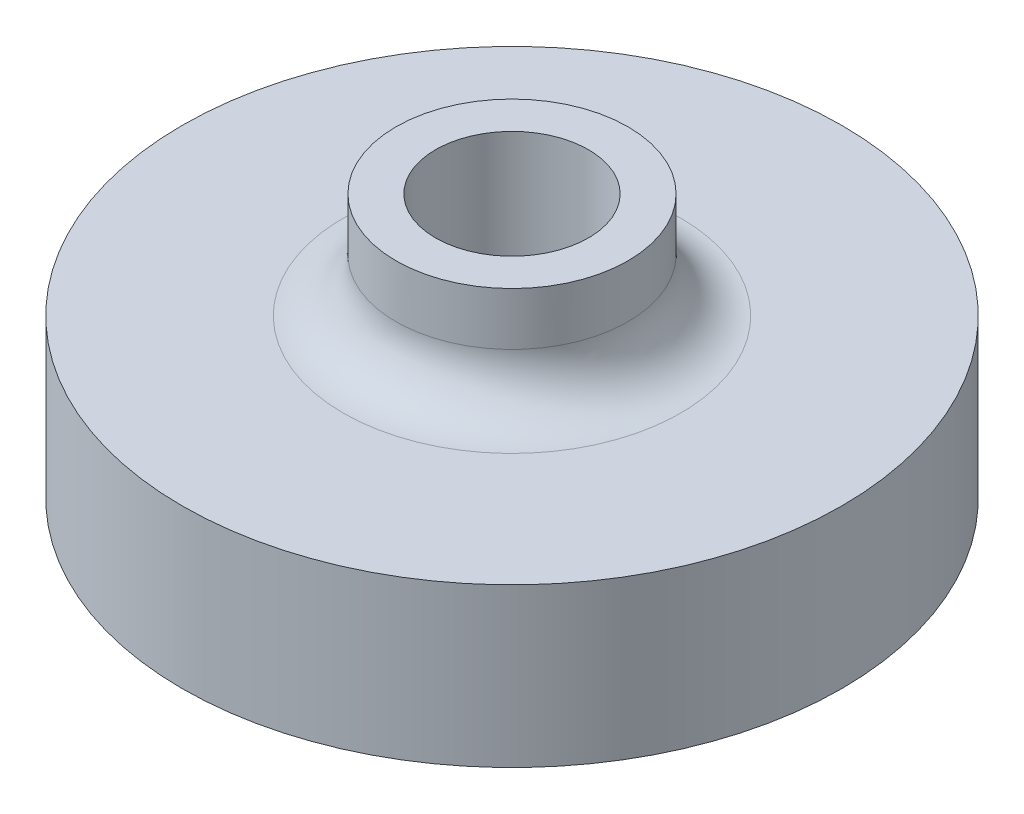
ISO-10303-21;
HEADER;
FILE_DESCRIPTION(('STEP AP214'),'2;1');
FILE_NAME('part.step','',(''),(''),'','','');
FILE_SCHEMA(('AUTOMOTIVE_DESIGN { 1 0 10303 214 1 1 1 1 }'));
ENDSEC;
DATA;
#1=APPLICATION_CONTEXT('core data for automotive mechanical design processes');
#2=APPLICATION_PROTOCOL_DEFINITION('international standard','automotive_design',2000,#1);
#3=PRODUCT_CONTEXT('',#1,'mechanical');
#4=PRODUCT('Part','Part','',(#3));
#5=PRODUCT_RELATED_PRODUCT_CATEGORY('part','',(#4));
#6=PRODUCT_DEFINITION_FORMATION('','',#4);
#7=PRODUCT_DEFINITION_CONTEXT('part definition',#1,'design');
#8=PRODUCT_DEFINITION('design','',#6,#7);
#9=PRODUCT_DEFINITION_SHAPE('','',#8);
#10=(LENGTH_UNIT() NAMED_UNIT(*) SI_UNIT(.MILLI.,.METRE.));
#11=(NAMED_UNIT(*) PLANE_ANGLE_UNIT() SI_UNIT($,.RADIAN.));
#12=(NAMED_UNIT(*) SI_UNIT($,.STERADIAN.) SOLID_ANGLE_UNIT());
#13=UNCERTAINTY_MEASURE_WITH_UNIT(LENGTH_MEASURE(1.E-05),#10,'distance_accuracy_value','');
#14=(GEOMETRIC_REPRESENTATION_CONTEXT(3) GLOBAL_UNCERTAINTY_ASSIGNED_CONTEXT((#13)) GLOBAL_UNIT_ASSIGNED_CONTEXT((#10,
#11,#12)) REPRESENTATION_CONTEXT('',''));
#15=CARTESIAN_POINT('',(0.,0.,0.));
#16=DIRECTION('',(0.,0.,1.));
#17=DIRECTION('',(1.,0.,0.));
#18=AXIS2_PLACEMENT_3D('',#15,#16,#17);
#19=CARTESIAN_POINT('',(1.5,4.5,0.));
#20=DIRECTION('',(1.,0.,0.));
#21=DIRECTION('',(0.,0.,-1.));
#22=AXIS2_PLACEMENT_3D('',#19,#20,#21);
#23=PLANE('',#22);
#24=DIRECTION('',(0.,0.,1.));
#25=VECTOR('',#24,1.);
#26=CARTESIAN_POINT('',(1.5,2.,0.));
#27=LINE('',#26,#25);
#28=CARTESIAN_POINT('',(1.5,2.,-4.99999859781734));
#29=VERTEX_POINT('',#28);
#30=CARTESIAN_POINT('',(1.5,2.,-1.15470053837924));
#31=VERTEX_POINT('',#30);
#32=EDGE_CURVE('E170',#29,#31,#27,.T.);
#33=ORIENTED_EDGE('',*,*,#32,.T.);
#34=DIRECTION('',(0.,-1.,0.));
#35=VECTOR('',#34,1.);
#36=CARTESIAN_POINT('',(1.5,4.5,-1.15470053837924));
#37=LINE('',#36,#35);
#38=CARTESIAN_POINT('',(1.5,4.5,-1.15470053837924));
#39=VERTEX_POINT('',#38);
#40=EDGE_CURVE('E169',#39,#31,#37,.T.);
#41=ORIENTED_EDGE('',*,*,#40,.F.);
#42=DIRECTION('',(0.,0.,1.));
#43=VECTOR('',#42,1.);
#44=CARTESIAN_POINT('',(1.5,4.5,0.));
#45=LINE('',#44,#43);
#46=CARTESIAN_POINT('',(1.5,4.5,-4.99999859781734));
#47=VERTEX_POINT('',#46);
#48=EDGE_CURVE('E185',#47,#39,#45,.T.);
#49=ORIENTED_EDGE('',*,*,#48,.F.);
#50=DIRECTION('',(0.,-1.,0.));
#51=VECTOR('',#50,1.);
#52=CARTESIAN_POINT('',(1.5,4.5,-4.99999859781734));
#53=LINE('',#52,#51);
#54=EDGE_CURVE('E56',#47,#29,#53,.T.);
#55=ORIENTED_EDGE('',*,*,#54,.T.);
#56=EDGE_LOOP('',(#33,#41,#49,#55));
#57=FACE_BOUND('',#56,.T.);
#58=ADVANCED_FACE('F46',(#57),#23,.F.);
#59=CARTESIAN_POINT('',(0.,4.5,-4.99999859781734));
#60=DIRECTION('',(0.,-1.,0.));
#61=DIRECTION('',(0.,0.,-1.));
#62=AXIS2_PLACEMENT_3D('',#59,#60,#61);
#63=CYLINDRICAL_SURFACE('',#62,1.5);
#64=DIRECTION('',(0.,-1.,0.));
#65=VECTOR('',#64,1.);
#66=CARTESIAN_POINT('',(-1.5,4.5,-4.99999859781734));
#67=LINE('',#66,#65);
#68=CARTESIAN_POINT('',(-1.5,4.5,-4.99999859781734));
#69=VERTEX_POINT('',#68);
#70=CARTESIAN_POINT('',(-1.50000028335584,2.,-4.99999859781734));
#71=VERTEX_POINT('',#70);
#72=EDGE_CURVE('E142',#69,#71,#67,.T.);
#73=ORIENTED_EDGE('',*,*,#72,.T.);
#74=CARTESIAN_POINT('',(0.,2.,-4.99999859781734));
#75=DIRECTION('',(0.,-1.,0.));
#76=DIRECTION('',(0.,0.,-1.));
#77=AXIS2_PLACEMENT_3D('',#74,#75,#76);
#78=CIRCLE('',#77,1.50000028335584);
#79=EDGE_CURVE('E113',#29,#71,#78,.T.);
#80=ORIENTED_EDGE('',*,*,#79,.F.);
#81=ORIENTED_EDGE('',*,*,#54,.F.);
#82=CARTESIAN_POINT('',(0.,4.5,-4.99999859781734));
#83=DIRECTION('',(0.,-1.,0.));
#84=DIRECTION('',(0.,0.,-1.));
#85=AXIS2_PLACEMENT_3D('',#82,#83,#84);
#86=CIRCLE('',#85,1.5);
#87=EDGE_CURVE('E146',#69,#47,#86,.T.);
#88=ORIENTED_EDGE('',*,*,#87,.F.);
#89=EDGE_LOOP('',(#73,#80,#81,#88));
#90=FACE_BOUND('',#89,.T.);
#91=CARTESIAN_POINT('',(0.,0.,-4.99999859781734));
#92=DIRECTION('',(0.,-1.,0.));
#93=DIRECTION('',(0.,0.,-1.));
#94=AXIS2_PLACEMENT_3D('',#91,#92,#93);
#95=CIRCLE('',#94,1.50000028335584);
#96=CARTESIAN_POINT('',(0.,0.,-6.49999888117318));
#97=VERTEX_POINT('',#96);
#98=EDGE_CURVE('E213',#97,#97,#95,.T.);
#99=ORIENTED_EDGE('',*,*,#98,.T.);
#100=EDGE_LOOP('',(#99));
#101=FACE_BOUND('',#100,.T.);
#102=ADVANCED_FACE('F317',(#90,#101),#63,.F.);
#103=CARTESIAN_POINT('',(-1.5,4.5,0.));
#104=DIRECTION('',(1.,0.,0.));
#105=DIRECTION('',(0.,0.,-1.));
#106=AXIS2_PLACEMENT_3D('',#103,#104,#105);
#107=PLANE('',#106);
#108=DIRECTION('',(0.,0.,1.));
#109=VECTOR('',#108,1.);
#110=CARTESIAN_POINT('',(-1.5,2.,0.));
#111=LINE('',#110,#109);
#112=CARTESIAN_POINT('',(-1.5,2.,0.));
#113=VERTEX_POINT('',#112);
#114=EDGE_CURVE('E183',#71,#113,#111,.T.);
#115=ORIENTED_EDGE('',*,*,#114,.F.);
#116=ORIENTED_EDGE('',*,*,#72,.F.);
#117=DIRECTION('',(0.,0.,1.));
#118=VECTOR('',#117,1.);
#119=CARTESIAN_POINT('',(-1.5,4.5,0.));
#120=LINE('',#119,#118);
#121=CARTESIAN_POINT('',(-1.5,4.5,0.));
#122=VERTEX_POINT('',#121);
#123=EDGE_CURVE('E137',#69,#122,#120,.T.);
#124=ORIENTED_EDGE('',*,*,#123,.T.);
#125=DIRECTION('',(0.,-1.,0.));
#126=VECTOR('',#125,1.);
#127=CARTESIAN_POINT('',(-1.5,4.5,0.));
#128=LINE('',#127,#126);
#129=EDGE_CURVE('E141',#122,#113,#128,.T.);
#130=ORIENTED_EDGE('',*,*,#129,.T.);
#131=EDGE_LOOP('',(#115,#116,#124,#130));
#132=FACE_BOUND('',#131,.T.);
#133=ADVANCED_FACE('F140',(#132),#107,.T.);
#134=CARTESIAN_POINT('',(0.,4.5,0.));
#135=DIRECTION('',(0.,-1.,0.));
#136=DIRECTION('',(0.,0.,-1.));
#137=AXIS2_PLACEMENT_3D('',#134,#135,#136);
#138=CYLINDRICAL_SURFACE('',#137,1.5);
#139=DIRECTION('',(0.,-1.,0.));
#140=VECTOR('',#139,1.);
#141=CARTESIAN_POINT('',(-0.749999999999991,4.5,1.29903810567666));
#142=LINE('',#141,#140);
#143=CARTESIAN_POINT('',(-0.749999999999991,4.5,1.29903810567666));
#144=VERTEX_POINT('',#143);
#145=CARTESIAN_POINT('',(-0.749999999999991,2.,1.29903810567666));
#146=VERTEX_POINT('',#145);
#147=EDGE_CURVE('E156',#144,#146,#142,.T.);
#148=ORIENTED_EDGE('',*,*,#147,.T.);
#149=CARTESIAN_POINT('',(0.,2.,0.));
#150=DIRECTION('',(0.,-1.,0.));
#151=DIRECTION('',(0.,0.,-1.));
#152=AXIS2_PLACEMENT_3D('',#149,#150,#151);
#153=CIRCLE('',#152,1.5);
#154=EDGE_CURVE('E155',#113,#146,#153,.T.);
#155=ORIENTED_EDGE('',*,*,#154,.F.);
#156=ORIENTED_EDGE('',*,*,#129,.F.);
#157=CARTESIAN_POINT('',(0.,4.5,0.));
#158=DIRECTION('',(0.,-1.,0.));
#159=DIRECTION('',(0.,0.,-1.));
#160=AXIS2_PLACEMENT_3D('',#157,#158,#159);
#161=CIRCLE('',#160,1.5);
#162=EDGE_CURVE('E147',#144,#122,#161,.T.);
#163=ORIENTED_EDGE('',*,*,#162,.F.);
#164=EDGE_LOOP('',(#148,#155,#156,#163));
#165=FACE_BOUND('',#164,.T.);
#166=CARTESIAN_POINT('',(0.,0.,0.));
#167=DIRECTION('',(0.,-1.,0.));
#168=DIRECTION('',(0.,0.,-1.));
#169=AXIS2_PLACEMENT_3D('',#166,#167,#168);
#170=CIRCLE('',#169,1.5);
#171=CARTESIAN_POINT('',(0.,0.,-1.5));
#172=VERTEX_POINT('',#171);
#173=EDGE_CURVE('E254',#172,#172,#170,.T.);
#174=ORIENTED_EDGE('',*,*,#173,.T.);
#175=EDGE_LOOP('',(#174));
#176=FACE_BOUND('',#175,.T.);
#177=ADVANCED_FACE('F153',(#165,#176),#138,.F.);
#178=CARTESIAN_POINT('',(-0.749999999999997,4.5,1.29903810567666));
#179=DIRECTION('',(0.499999999999998,0.,-0.86602540378444));
#180=DIRECTION('',(-0.86602540378444,0.,-0.499999999999998));
#181=AXIS2_PLACEMENT_3D('',#178,#179,#180);
#182=PLANE('',#181);
#183=DIRECTION('',(0.86602540378444,0.,0.499999999999998));
#184=VECTOR('',#183,1.);
#185=CARTESIAN_POINT('',(-0.749999999999997,2.,1.29903810567666));
#186=LINE('',#185,#184);
#187=CARTESIAN_POINT('',(3.58012739648833,2.,3.79903832366455));
#188=VERTEX_POINT('',#187);
#189=EDGE_CURVE('E180',#146,#188,#186,.T.);
#190=ORIENTED_EDGE('',*,*,#189,.F.);
#191=ORIENTED_EDGE('',*,*,#147,.F.);
#192=DIRECTION('',(0.86602540378444,0.,0.499999999999998));
#193=VECTOR('',#192,1.);
#194=CARTESIAN_POINT('',(-0.749999999999997,4.5,1.29903810567666));
#195=LINE('',#194,#193);
#196=CARTESIAN_POINT('',(3.58012739648833,4.5,3.79903832366455));
#197=VERTEX_POINT('',#196);
#198=EDGE_CURVE('E162',#144,#197,#195,.T.);
#199=ORIENTED_EDGE('',*,*,#198,.T.);
#200=DIRECTION('',(0.,-1.,0.));
#201=VECTOR('',#200,1.);
#202=CARTESIAN_POINT('',(3.58012739648833,4.5,3.79903832366455));
#203=LINE('',#202,#201);
#204=EDGE_CURVE('E189',#197,#188,#203,.T.);
#205=ORIENTED_EDGE('',*,*,#204,.T.);
#206=EDGE_LOOP('',(#190,#191,#199,#205));
#207=FACE_BOUND('',#206,.T.);
#208=ADVANCED_FACE('F280',(#207),#182,.T.);
#209=CARTESIAN_POINT('',(4.33012739648833,4.5,2.5000002179879));
#210=DIRECTION('',(0.,-1.,0.));
#211=DIRECTION('',(0.,0.,-1.));
#212=AXIS2_PLACEMENT_3D('',#209,#210,#211);
#213=CYLINDRICAL_SURFACE('',#212,1.5);
#214=DIRECTION('',(0.,-1.,0.));
#215=VECTOR('',#214,1.);
#216=CARTESIAN_POINT('',(5.08012701892206,4.5,1.20096189432333));
#217=LINE('',#216,#215);
#218=CARTESIAN_POINT('',(5.08012701892206,4.5,1.20096189432333));
#219=VERTEX_POINT('',#218);
#220=CARTESIAN_POINT('',(5.08012701892206,2.,1.20096189432333));
#221=VERTEX_POINT('',#220);
#222=EDGE_CURVE('E192',#219,#221,#217,.T.);
#223=ORIENTED_EDGE('',*,*,#222,.T.);
#224=CARTESIAN_POINT('',(4.33012739648833,2.,2.5000002179879));
#225=DIRECTION('',(0.,-1.,0.));
#226=DIRECTION('',(0.,0.,-1.));
#227=AXIS2_PLACEMENT_3D('',#224,#225,#226);
#228=CIRCLE('',#227,1.5);
#229=EDGE_CURVE('E248',#188,#221,#228,.T.);
#230=ORIENTED_EDGE('',*,*,#229,.F.);
#231=ORIENTED_EDGE('',*,*,#204,.F.);
#232=CARTESIAN_POINT('',(4.33012739648833,4.5,2.5000002179879));
#233=DIRECTION('',(0.,-1.,0.));
#234=DIRECTION('',(0.,0.,-1.));
#235=AXIS2_PLACEMENT_3D('',#232,#233,#234);
#236=CIRCLE('',#235,1.5);
#237=EDGE_CURVE('E164',#219,#197,#236,.T.);
#238=ORIENTED_EDGE('',*,*,#237,.F.);
#239=EDGE_LOOP('',(#223,#230,#231,#238));
#240=FACE_BOUND('',#239,.T.);
#241=CARTESIAN_POINT('',(4.33012739648833,0.,2.5000002179879));
#242=DIRECTION('',(0.,-1.,0.));
#243=DIRECTION('',(0.,0.,-1.));
#244=AXIS2_PLACEMENT_3D('',#241,#242,#243);
#245=CIRCLE('',#244,1.5);
#246=CARTESIAN_POINT('',(4.33012739648833,0.,1.0000002179879));
#247=VERTEX_POINT('',#246);
#248=EDGE_CURVE('E250',#247,#247,#245,.T.);
#249=ORIENTED_EDGE('',*,*,#248,.T.);
#250=EDGE_LOOP('',(#249));
#251=FACE_BOUND('',#250,.T.);
#252=ADVANCED_FACE('F275',(#240,#251),#213,.F.);
#253=CARTESIAN_POINT('',(0.750000000000017,4.5,-1.29903810567665));
#254=DIRECTION('',(-0.50000000000001,0.,0.866025403784433));
#255=DIRECTION('',(0.866025403784433,0.,0.50000000000001));
#256=AXIS2_PLACEMENT_3D('',#253,#254,#255);
#257=PLANE('',#256);
#258=DIRECTION('',(-0.866025403784433,0.,-0.50000000000001));
#259=VECTOR('',#258,1.);
#260=CARTESIAN_POINT('',(0.750000000000017,2.,-1.29903810567665));
#261=LINE('',#260,#259);
#262=CARTESIAN_POINT('',(1.75,2.,-0.721687836487021));
#263=VERTEX_POINT('',#262);
#264=EDGE_CURVE('E177',#221,#263,#261,.T.);
#265=ORIENTED_EDGE('',*,*,#264,.F.);
#266=ORIENTED_EDGE('',*,*,#222,.F.);
#267=DIRECTION('',(-0.866025403784433,0.,-0.50000000000001));
#268=VECTOR('',#267,1.);
#269=CARTESIAN_POINT('',(0.750000000000017,4.5,-1.29903810567665));
#270=LINE('',#269,#268);
#271=CARTESIAN_POINT('',(1.75,4.5,-0.721687836487021));
#272=VERTEX_POINT('',#271);
#273=EDGE_CURVE('E270',#219,#272,#270,.T.);
#274=ORIENTED_EDGE('',*,*,#273,.T.);
#275=DIRECTION('',(0.,-1.,0.));
#276=VECTOR('',#275,1.);
#277=CARTESIAN_POINT('',(1.75,4.5,-0.721687836487021));
#278=LINE('',#277,#276);
#279=EDGE_CURVE('E195',#272,#263,#278,.T.);
#280=ORIENTED_EDGE('',*,*,#279,.T.);
#281=EDGE_LOOP('',(#265,#266,#274,#280));
#282=FACE_BOUND('',#281,.T.);
#283=ADVANCED_FACE('F327',(#282),#257,.T.);
#284=CARTESIAN_POINT('',(2.,4.5,-1.15470053837924));
#285=DIRECTION('',(0.,-1.,0.));
#286=DIRECTION('',(0.,0.,-1.));
#287=AXIS2_PLACEMENT_3D('',#284,#285,#286);
#288=CYLINDRICAL_SURFACE('',#287,0.499999999999999);
#289=CARTESIAN_POINT('',(2.,2.,-1.15470053837924));
#290=DIRECTION('',(0.,-1.,0.));
#291=DIRECTION('',(0.,0.,-1.));
#292=AXIS2_PLACEMENT_3D('',#289,#290,#291);
#293=CIRCLE('',#292,0.499999999999999);
#294=EDGE_CURVE('E173',#31,#263,#293,.F.);
#295=ORIENTED_EDGE('',*,*,#294,.T.);
#296=ORIENTED_EDGE('',*,*,#279,.F.);
#297=CARTESIAN_POINT('',(2.,4.5,-1.15470053837924));
#298=DIRECTION('',(0.,-1.,0.));
#299=DIRECTION('',(0.,0.,-1.));
#300=AXIS2_PLACEMENT_3D('',#297,#298,#299);
#301=CIRCLE('',#300,0.499999999999999);
#302=EDGE_CURVE('E267',#39,#272,#301,.F.);
#303=ORIENTED_EDGE('',*,*,#302,.F.);
#304=ORIENTED_EDGE('',*,*,#40,.T.);
#305=EDGE_LOOP('',(#295,#296,#303,#304));
#306=FACE_BOUND('',#305,.T.);
#307=ADVANCED_FACE('F324',(#306),#288,.T.);
#308=CARTESIAN_POINT('',(0.,4.5,0.));
#309=DIRECTION('',(0.,-1.,0.));
#310=DIRECTION('',(0.,0.,-1.));
#311=AXIS2_PLACEMENT_3D('',#308,#309,#310);
#312=PLANE('',#311);
#313=ORIENTED_EDGE('',*,*,#48,.T.);
#314=ORIENTED_EDGE('',*,*,#302,.T.);
#315=ORIENTED_EDGE('',*,*,#273,.F.);
#316=ORIENTED_EDGE('',*,*,#237,.T.);
#317=ORIENTED_EDGE('',*,*,#198,.F.);
#318=ORIENTED_EDGE('',*,*,#162,.T.);
#319=ORIENTED_EDGE('',*,*,#123,.F.);
#320=ORIENTED_EDGE('',*,*,#87,.T.);
#321=EDGE_LOOP('',(#313,#314,#315,#316,#317,#318,#319,#320));
#322=FACE_BOUND('',#321,.T.);
#323=ADVANCED_FACE('F160',(#322),#312,.T.);
#324=CARTESIAN_POINT('',(0.,2.,0.));
#325=DIRECTION('',(0.,-1.,0.));
#326=DIRECTION('',(0.,0.,-1.));
#327=AXIS2_PLACEMENT_3D('',#324,#325,#326);
#328=PLANE('',#327);
#329=ORIENTED_EDGE('',*,*,#32,.F.);
#330=ORIENTED_EDGE('',*,*,#79,.T.);
#331=ORIENTED_EDGE('',*,*,#114,.T.);
#332=ORIENTED_EDGE('',*,*,#154,.T.);
#333=ORIENTED_EDGE('',*,*,#189,.T.);
#334=ORIENTED_EDGE('',*,*,#229,.T.);
#335=ORIENTED_EDGE('',*,*,#264,.T.);
#336=ORIENTED_EDGE('',*,*,#294,.F.);
#337=EDGE_LOOP('',(#329,#330,#331,#332,#333,#334,#335,#336));
#338=FACE_BOUND('',#337,.T.);
#339=ADVANCED_FACE('F281',(#338),#328,.F.);
#340=CARTESIAN_POINT('',(0.,10.,0.));
#341=DIRECTION('',(0.,-1.,0.));
#342=DIRECTION('',(0.,0.,-1.));
#343=AXIS2_PLACEMENT_3D('',#340,#341,#342);
#344=CYLINDRICAL_SURFACE('',#343,12.4999999999993);
#345=CARTESIAN_POINT('',(0.,6.,0.));
#346=DIRECTION('',(0.,-1.,0.));
#347=DIRECTION('',(0.,0.,-1.));
#348=AXIS2_PLACEMENT_3D('',#345,#346,#347);
#349=CIRCLE('',#348,12.4999999999993);
#350=CARTESIAN_POINT('',(0.,6.,-12.4999999999993));
#351=VERTEX_POINT('',#350);
#352=EDGE_CURVE('E50',#351,#351,#349,.T.);
#353=ORIENTED_EDGE('',*,*,#352,.T.);
#354=EDGE_LOOP('',(#353));
#355=FACE_BOUND('',#354,.T.);
#356=CARTESIAN_POINT('',(0.,0.,0.));
#357=DIRECTION('',(0.,1.,0.));
#358=DIRECTION('',(0.,0.,1.));
#359=AXIS2_PLACEMENT_3D('',#356,#357,#358);
#360=CIRCLE('',#359,12.4999999999993);
#361=CARTESIAN_POINT('',(0.,0.,12.4999999999993));
#362=VERTEX_POINT('',#361);
#363=EDGE_CURVE('E11',#362,#362,#360,.T.);
#364=ORIENTED_EDGE('',*,*,#363,.T.);
#365=EDGE_LOOP('',(#364));
#366=FACE_BOUND('',#365,.T.);
#367=ADVANCED_FACE('F48',(#355,#366),#344,.T.);
#368=CARTESIAN_POINT('',(0.,0.,0.));
#369=DIRECTION('',(0.,1.,0.));
#370=DIRECTION('',(0.,0.,1.));
#371=AXIS2_PLACEMENT_3D('',#368,#369,#370);
#372=PLANE('',#371);
#373=ORIENTED_EDGE('',*,*,#98,.F.);
#374=EDGE_LOOP('',(#373));
#375=FACE_BOUND('',#374,.T.);
#376=ORIENTED_EDGE('',*,*,#248,.F.);
#377=EDGE_LOOP('',(#376));
#378=FACE_BOUND('',#377,.T.);
#379=ORIENTED_EDGE('',*,*,#173,.F.);
#380=EDGE_LOOP('',(#379));
#381=FACE_BOUND('',#380,.T.);
#382=CARTESIAN_POINT('',(-8.6602540378444,0.,4.99999999999998));
#383=DIRECTION('',(0.,-1.,0.));
#384=DIRECTION('',(0.,0.,-1.));
#385=AXIS2_PLACEMENT_3D('',#382,#383,#384);
#386=CIRCLE('',#385,1.5);
#387=CARTESIAN_POINT('',(-8.6602540378444,0.,3.49999999999998));
#388=VERTEX_POINT('',#387);
#389=EDGE_CURVE('E258',#388,#388,#386,.T.);
#390=ORIENTED_EDGE('',*,*,#389,.F.);
#391=EDGE_LOOP('',(#390));
#392=FACE_BOUND('',#391,.T.);
#393=CARTESIAN_POINT('',(-4.3301270189222,0.,2.49999999999999));
#394=DIRECTION('',(0.,-1.,0.));
#395=DIRECTION('',(0.,0.,-1.));
#396=AXIS2_PLACEMENT_3D('',#393,#394,#395);
#397=CIRCLE('',#396,1.5);
#398=CARTESIAN_POINT('',(-4.3301270189222,0.,0.999999999999988));
#399=VERTEX_POINT('',#398);
#400=EDGE_CURVE('E242',#399,#399,#397,.T.);
#401=ORIENTED_EDGE('',*,*,#400,.F.);
#402=EDGE_LOOP('',(#401));
#403=FACE_BOUND('',#402,.T.);
#404=ORIENTED_EDGE('',*,*,#363,.F.);
#405=EDGE_LOOP('',(#404));
#406=FACE_BOUND('',#405,.T.);
#407=ADVANCED_FACE('F396',(#375,#378,#381,#392,#403,#406),#372,.F.);
#408=CARTESIAN_POINT('',(0.749999999999996,4.5,1.29903810567666));
#409=DIRECTION('',(-0.499999999999998,0.,-0.86602540378444));
#410=DIRECTION('',(-0.86602540378444,0.,0.499999999999998));
#411=AXIS2_PLACEMENT_3D('',#408,#409,#410);
#412=PLANE('',#411);
#413=DIRECTION('',(0.86602540378444,0.,-0.499999999999998));
#414=VECTOR('',#413,1.);
#415=CARTESIAN_POINT('',(0.749999999999996,2.,1.29903810567666));
#416=LINE('',#415,#414);
#417=CARTESIAN_POINT('',(-7.9102540378444,2.,6.29903810567664));
#418=VERTEX_POINT('',#417);
#419=CARTESIAN_POINT('',(-3.5801270189222,2.,3.79903810567665));
#420=VERTEX_POINT('',#419);
#421=EDGE_CURVE('E211',#418,#420,#416,.T.);
#422=ORIENTED_EDGE('',*,*,#421,.F.);
#423=DIRECTION('',(0.,-1.,0.));
#424=VECTOR('',#423,1.);
#425=CARTESIAN_POINT('',(-7.9102540378444,4.5,6.29903810567664));
#426=LINE('',#425,#424);
#427=CARTESIAN_POINT('',(-7.9102540378444,4.5,6.29903810567664));
#428=VERTEX_POINT('',#427);
#429=EDGE_CURVE('E210',#428,#418,#426,.T.);
#430=ORIENTED_EDGE('',*,*,#429,.F.);
#431=DIRECTION('',(0.86602540378444,0.,-0.499999999999998));
#432=VECTOR('',#431,1.);
#433=CARTESIAN_POINT('',(0.749999999999996,4.5,1.29903810567666));
#434=LINE('',#433,#432);
#435=CARTESIAN_POINT('',(-3.5801270189222,4.5,3.79903810567665));
#436=VERTEX_POINT('',#435);
#437=EDGE_CURVE('E198',#428,#436,#434,.T.);
#438=ORIENTED_EDGE('',*,*,#437,.T.);
#439=DIRECTION('',(0.,-1.,0.));
#440=VECTOR('',#439,1.);
#441=CARTESIAN_POINT('',(-3.5801270189222,4.5,3.79903810567665));
#442=LINE('',#441,#440);
#443=EDGE_CURVE('E174',#436,#420,#442,.T.);
#444=ORIENTED_EDGE('',*,*,#443,.T.);
#445=EDGE_LOOP('',(#422,#430,#438,#444));
#446=FACE_BOUND('',#445,.T.);
#447=ADVANCED_FACE('F302',(#446),#412,.T.);
#448=CARTESIAN_POINT('',(-4.3301270189222,4.5,2.49999999999999));
#449=DIRECTION('',(0.,-1.,0.));
#450=DIRECTION('',(0.,0.,-1.));
#451=AXIS2_PLACEMENT_3D('',#448,#449,#450);
#452=CYLINDRICAL_SURFACE('',#451,1.5);
#453=DIRECTION('',(0.,-1.,0.));
#454=VECTOR('',#453,1.);
#455=CARTESIAN_POINT('',(-5.0801270189222,4.5,1.20096189432333));
#456=LINE('',#455,#454);
#457=CARTESIAN_POINT('',(-5.0801270189222,4.5,1.20096189432333));
#458=VERTEX_POINT('',#457);
#459=CARTESIAN_POINT('',(-5.0801270189222,2.,1.20096189432333));
#460=VERTEX_POINT('',#459);
#461=EDGE_CURVE('E218',#458,#460,#456,.T.);
#462=ORIENTED_EDGE('',*,*,#461,.T.);
#463=CARTESIAN_POINT('',(-4.3301270189222,2.,2.49999999999999));
#464=DIRECTION('',(0.,-1.,0.));
#465=DIRECTION('',(0.,0.,-1.));
#466=AXIS2_PLACEMENT_3D('',#463,#464,#465);
#467=CIRCLE('',#466,1.5);
#468=EDGE_CURVE('E261',#420,#460,#467,.T.);
#469=ORIENTED_EDGE('',*,*,#468,.F.);
#470=ORIENTED_EDGE('',*,*,#443,.F.);
#471=CARTESIAN_POINT('',(-4.3301270189222,4.5,2.49999999999999));
#472=DIRECTION('',(0.,-1.,0.));
#473=DIRECTION('',(0.,0.,-1.));
#474=AXIS2_PLACEMENT_3D('',#471,#472,#473);
#475=CIRCLE('',#474,1.5);
#476=EDGE_CURVE('E207',#458,#436,#475,.T.);
#477=ORIENTED_EDGE('',*,*,#476,.F.);
#478=EDGE_LOOP('',(#462,#469,#470,#477));
#479=FACE_BOUND('',#478,.T.);
#480=ORIENTED_EDGE('',*,*,#400,.T.);
#481=EDGE_LOOP('',(#480));
#482=FACE_BOUND('',#481,.T.);
#483=ADVANCED_FACE('F291',(#479,#482),#452,.F.);
#484=CARTESIAN_POINT('',(-0.749999999999997,4.5,-1.29903810567666));
#485=DIRECTION('',(-0.499999999999998,0.,-0.86602540378444));
#486=DIRECTION('',(-0.86602540378444,0.,0.499999999999998));
#487=AXIS2_PLACEMENT_3D('',#484,#485,#486);
#488=PLANE('',#487);
#489=DIRECTION('',(0.86602540378444,0.,-0.499999999999998));
#490=VECTOR('',#489,1.);
#491=CARTESIAN_POINT('',(-0.749999999999997,2.,-1.29903810567666));
#492=LINE('',#491,#490);
#493=CARTESIAN_POINT('',(-9.4102540378444,2.,3.70096189432332));
#494=VERTEX_POINT('',#493);
#495=EDGE_CURVE('E201',#494,#460,#492,.T.);
#496=ORIENTED_EDGE('',*,*,#495,.T.);
#497=ORIENTED_EDGE('',*,*,#461,.F.);
#498=DIRECTION('',(0.86602540378444,0.,-0.499999999999998));
#499=VECTOR('',#498,1.);
#500=CARTESIAN_POINT('',(-0.749999999999997,4.5,-1.29903810567666));
#501=LINE('',#500,#499);
#502=CARTESIAN_POINT('',(-9.41025403784439,4.5,3.70096189432331));
#503=VERTEX_POINT('',#502);
#504=EDGE_CURVE('E204',#503,#458,#501,.T.);
#505=ORIENTED_EDGE('',*,*,#504,.F.);
#506=DIRECTION('',(0.,-1.,0.));
#507=VECTOR('',#506,1.);
#508=CARTESIAN_POINT('',(-9.41025403784439,4.5,3.70096189432331));
#509=LINE('',#508,#507);
#510=EDGE_CURVE('E221',#503,#494,#509,.T.);
#511=ORIENTED_EDGE('',*,*,#510,.T.);
#512=EDGE_LOOP('',(#496,#497,#505,#511));
#513=FACE_BOUND('',#512,.T.);
#514=ADVANCED_FACE('F295',(#513),#488,.F.);
#515=CARTESIAN_POINT('',(-8.6602540378444,4.5,4.99999999999998));
#516=DIRECTION('',(0.,-1.,0.));
#517=DIRECTION('',(0.,0.,-1.));
#518=AXIS2_PLACEMENT_3D('',#515,#516,#517);
#519=CYLINDRICAL_SURFACE('',#518,1.5);
#520=ORIENTED_EDGE('',*,*,#429,.T.);
#521=CARTESIAN_POINT('',(-8.6602540378444,2.,4.99999999999998));
#522=DIRECTION('',(0.,-1.,0.));
#523=DIRECTION('',(0.,0.,-1.));
#524=AXIS2_PLACEMENT_3D('',#521,#522,#523);
#525=CIRCLE('',#524,1.5);
#526=EDGE_CURVE('E104',#494,#418,#525,.T.);
#527=ORIENTED_EDGE('',*,*,#526,.F.);
#528=ORIENTED_EDGE('',*,*,#510,.F.);
#529=CARTESIAN_POINT('',(-8.6602540378444,4.5,4.99999999999998));
#530=DIRECTION('',(0.,-1.,0.));
#531=DIRECTION('',(0.,0.,-1.));
#532=AXIS2_PLACEMENT_3D('',#529,#530,#531);
#533=CIRCLE('',#532,1.5);
#534=EDGE_CURVE('E200',#428,#503,#533,.T.);
#535=ORIENTED_EDGE('',*,*,#534,.F.);
#536=EDGE_LOOP('',(#520,#527,#528,#535));
#537=FACE_BOUND('',#536,.T.);
#538=ORIENTED_EDGE('',*,*,#389,.T.);
#539=EDGE_LOOP('',(#538));
#540=FACE_BOUND('',#539,.T.);
#541=ADVANCED_FACE('F298',(#537,#540),#519,.F.);
#542=CARTESIAN_POINT('',(0.,4.5,0.));
#543=DIRECTION('',(0.,-1.,0.));
#544=DIRECTION('',(0.,0.,-1.));
#545=AXIS2_PLACEMENT_3D('',#542,#543,#544);
#546=PLANE('',#545);
#547=ORIENTED_EDGE('',*,*,#437,.F.);
#548=ORIENTED_EDGE('',*,*,#534,.T.);
#549=ORIENTED_EDGE('',*,*,#504,.T.);
#550=ORIENTED_EDGE('',*,*,#476,.T.);
#551=EDGE_LOOP('',(#547,#548,#549,#550));
#552=FACE_BOUND('',#551,.T.);
#553=ADVANCED_FACE('F304',(#552),#546,.T.);
#554=CARTESIAN_POINT('',(0.,2.,0.));
#555=DIRECTION('',(0.,-1.,0.));
#556=DIRECTION('',(0.,0.,-1.));
#557=AXIS2_PLACEMENT_3D('',#554,#555,#556);
#558=PLANE('',#557);
#559=ORIENTED_EDGE('',*,*,#495,.F.);
#560=ORIENTED_EDGE('',*,*,#526,.T.);
#561=ORIENTED_EDGE('',*,*,#421,.T.);
#562=ORIENTED_EDGE('',*,*,#468,.T.);
#563=EDGE_LOOP('',(#559,#560,#561,#562));
#564=FACE_BOUND('',#563,.T.);
#565=ADVANCED_FACE('F286',(#564),#558,.F.);
#566=CARTESIAN_POINT('',(21.4985339764123,6.,0.));
#567=DIRECTION('',(0.,-1.,0.));
#568=DIRECTION('',(0.,0.,-1.));
#569=AXIS2_PLACEMENT_3D('',#566,#567,#568);
#570=PLANE('',#569);
#571=CARTESIAN_POINT('',(0.,6.,0.));
#572=DIRECTION('',(0.,-1.,0.));
#573=DIRECTION('',(0.,0.,-1.));
#574=AXIS2_PLACEMENT_3D('',#571,#572,#573);
#575=CIRCLE('',#574,6.40000000000001);
#576=CARTESIAN_POINT('',(0.,6.,-6.40000000000001));
#577=VERTEX_POINT('',#576);
#578=EDGE_CURVE('E226',#577,#577,#575,.T.);
#579=ORIENTED_EDGE('',*,*,#578,.T.);
#580=EDGE_LOOP('',(#579));
#581=FACE_BOUND('',#580,.T.);
#582=ORIENTED_EDGE('',*,*,#352,.F.);
#583=EDGE_LOOP('',(#582));
#584=FACE_BOUND('',#583,.T.);
#585=ADVANCED_FACE('F312',(#581,#584),#570,.F.);
#586=CARTESIAN_POINT('',(0.,8.,0.));
#587=DIRECTION('',(0.,-1.,0.));
#588=DIRECTION('',(0.,0.,-1.));
#589=AXIS2_PLACEMENT_3D('',#586,#587,#588);
#590=TOROIDAL_SURFACE('',#589,6.4,2.);
#591=ORIENTED_EDGE('',*,*,#578,.F.);
#592=EDGE_LOOP('',(#591));
#593=FACE_BOUND('',#592,.T.);
#594=CARTESIAN_POINT('',(0.,8.00000000000001,0.));
#595=DIRECTION('',(0.,-1.,0.));
#596=DIRECTION('',(0.,0.,-1.));
#597=AXIS2_PLACEMENT_3D('',#594,#595,#596);
#598=CIRCLE('',#597,4.4);
#599=CARTESIAN_POINT('',(0.,8.00000000000001,-4.4));
#600=VERTEX_POINT('',#599);
#601=EDGE_CURVE('E232',#600,#600,#598,.T.);
#602=ORIENTED_EDGE('',*,*,#601,.T.);
#603=EDGE_LOOP('',(#602));
#604=FACE_BOUND('',#603,.T.);
#605=ADVANCED_FACE('F355',(#593,#604),#590,.F.);
#606=CARTESIAN_POINT('',(0.,-2.1728579572823,0.));
#607=DIRECTION('',(0.,-1.,0.));
#608=DIRECTION('',(0.,0.,-1.));
#609=AXIS2_PLACEMENT_3D('',#606,#607,#608);
#610=CYLINDRICAL_SURFACE('',#609,4.4);
#611=CARTESIAN_POINT('',(0.,10.,0.));
#612=DIRECTION('',(0.,1.,0.));
#613=DIRECTION('',(0.,0.,1.));
#614=AXIS2_PLACEMENT_3D('',#611,#612,#613);
#615=CIRCLE('',#614,4.4);
#616=CARTESIAN_POINT('',(0.,10.,4.4));
#617=VERTEX_POINT('',#616);
#618=EDGE_CURVE('E224',#617,#617,#615,.F.);
#619=ORIENTED_EDGE('',*,*,#618,.T.);
#620=EDGE_LOOP('',(#619));
#621=FACE_BOUND('',#620,.T.);
#622=ORIENTED_EDGE('',*,*,#601,.F.);
#623=EDGE_LOOP('',(#622));
#624=FACE_BOUND('',#623,.T.);
#625=ADVANCED_FACE('F351',(#621,#624),#610,.T.);
#626=CARTESIAN_POINT('',(0.,5.5,0.));
#627=DIRECTION('',(0.,1.,0.));
#628=DIRECTION('',(0.,0.,1.));
#629=AXIS2_PLACEMENT_3D('',#626,#627,#628);
#630=PLANE('',#629);
#631=CARTESIAN_POINT('',(0.,5.5,0.));
#632=DIRECTION('',(0.,1.,0.));
#633=DIRECTION('',(0.,0.,1.));
#634=AXIS2_PLACEMENT_3D('',#631,#632,#633);
#635=CIRCLE('',#634,2.9);
#636=CARTESIAN_POINT('',(0.,5.5,2.9));
#637=VERTEX_POINT('',#636);
#638=EDGE_CURVE('E239',#637,#637,#635,.T.);
#639=ORIENTED_EDGE('',*,*,#638,.T.);
#640=EDGE_LOOP('',(#639));
#641=FACE_BOUND('',#640,.T.);
#642=ADVANCED_FACE('F347',(#641),#630,.T.);
#643=CARTESIAN_POINT('',(0.,5.5,0.));
#644=DIRECTION('',(0.,1.,0.));
#645=DIRECTION('',(0.,0.,1.));
#646=AXIS2_PLACEMENT_3D('',#643,#644,#645);
#647=CYLINDRICAL_SURFACE('',#646,2.9);
#648=ORIENTED_EDGE('',*,*,#638,.F.);
#649=EDGE_LOOP('',(#648));
#650=FACE_BOUND('',#649,.T.);
#651=CARTESIAN_POINT('',(0.,10.,0.));
#652=DIRECTION('',(0.,1.,0.));
#653=DIRECTION('',(0.,0.,1.));
#654=AXIS2_PLACEMENT_3D('',#651,#652,#653);
#655=CIRCLE('',#654,2.9);
#656=CARTESIAN_POINT('',(0.,10.,2.9));
#657=VERTEX_POINT('',#656);
#658=EDGE_CURVE('E230',#657,#657,#655,.T.);
#659=ORIENTED_EDGE('',*,*,#658,.T.);
#660=EDGE_LOOP('',(#659));
#661=FACE_BOUND('',#660,.T.);
#662=ADVANCED_FACE('F343',(#650,#661),#647,.F.);
#663=CARTESIAN_POINT('',(0.,10.,0.));
#664=DIRECTION('',(0.,1.,0.));
#665=DIRECTION('',(0.,0.,1.));
#666=AXIS2_PLACEMENT_3D('',#663,#664,#665);
#667=PLANE('',#666);
#668=ORIENTED_EDGE('',*,*,#658,.F.);
#669=EDGE_LOOP('',(#668));
#670=FACE_BOUND('',#669,.T.);
#671=ORIENTED_EDGE('',*,*,#618,.F.);
#672=EDGE_LOOP('',(#671));
#673=FACE_BOUND('',#672,.T.);
#674=ADVANCED_FACE('F346',(#670,#673),#667,.T.);
#675=CLOSED_SHELL('',(#58,#102,#133,#177,#208,#252,#283,#307,#323,#339,#367,#407,#447,#483,#514,
#541,#553,#565,#585,#605,#625,#642,#662,#674));
#676=MANIFOLD_SOLID_BREP('B2',#675);
#677=ADVANCED_BREP_SHAPE_REPRESENTATION('',(#18,#676),#14);
#678=SHAPE_DEFINITION_REPRESENTATION(#9,#677);
ENDSEC;
END-ISO-10303-21;
